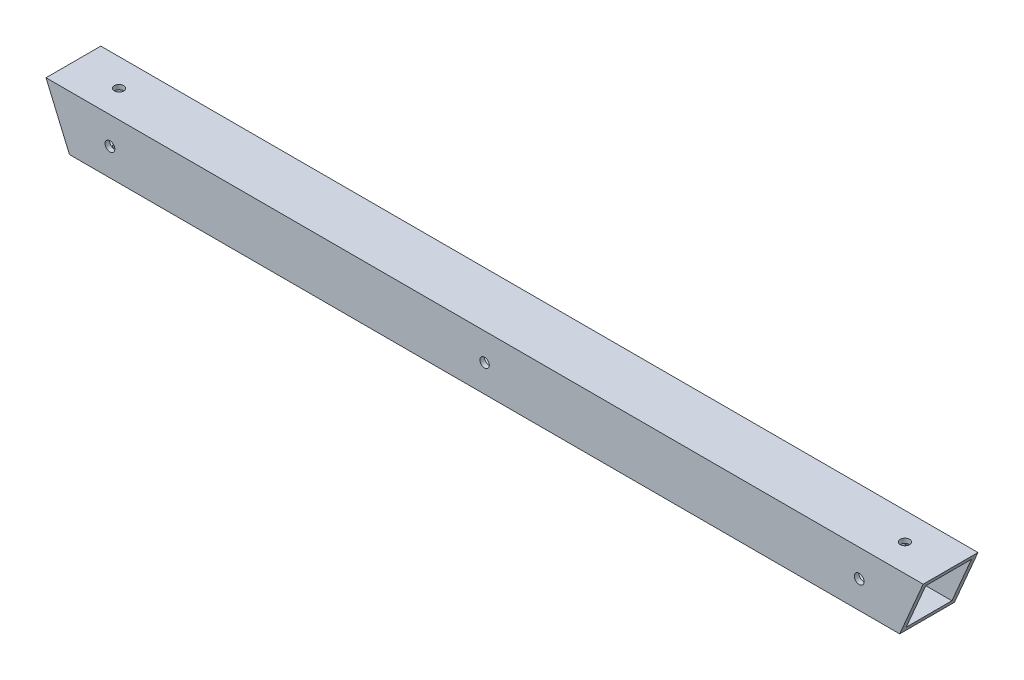
ISO-10303-21;
HEADER;
FILE_DESCRIPTION(('STEP AP214'),'2;1');
FILE_NAME('part.step','',(''),(''),'','','');
FILE_SCHEMA(('AUTOMOTIVE_DESIGN { 1 0 10303 214 1 1 1 1 }'));
ENDSEC;
DATA;
#1=APPLICATION_CONTEXT('core data for automotive mechanical design processes');
#2=APPLICATION_PROTOCOL_DEFINITION('international standard','automotive_design',2000,#1);
#3=PRODUCT_CONTEXT('',#1,'mechanical');
#4=PRODUCT('Part','Part','',(#3));
#5=PRODUCT_RELATED_PRODUCT_CATEGORY('part','',(#4));
#6=PRODUCT_DEFINITION_FORMATION('','',#4);
#7=PRODUCT_DEFINITION_CONTEXT('part definition',#1,'design');
#8=PRODUCT_DEFINITION('design','',#6,#7);
#9=PRODUCT_DEFINITION_SHAPE('','',#8);
#10=(LENGTH_UNIT() NAMED_UNIT(*) SI_UNIT(.MILLI.,.METRE.));
#11=(NAMED_UNIT(*) PLANE_ANGLE_UNIT() SI_UNIT($,.RADIAN.));
#12=(NAMED_UNIT(*) SI_UNIT($,.STERADIAN.) SOLID_ANGLE_UNIT());
#13=UNCERTAINTY_MEASURE_WITH_UNIT(LENGTH_MEASURE(1.E-05),#10,'distance_accuracy_value','');
#14=(GEOMETRIC_REPRESENTATION_CONTEXT(3) GLOBAL_UNCERTAINTY_ASSIGNED_CONTEXT((#13)) GLOBAL_UNIT_ASSIGNED_CONTEXT((#10,
#11,#12)) REPRESENTATION_CONTEXT('',''));
#15=CARTESIAN_POINT('',(0.,0.,0.));
#16=DIRECTION('',(0.,0.,1.));
#17=DIRECTION('',(1.,0.,0.));
#18=AXIS2_PLACEMENT_3D('',#15,#16,#17);
#19=CARTESIAN_POINT('',(304.8,1009.65,-38.1));
#20=DIRECTION('',(0.,-1.,0.));
#21=DIRECTION('',(0.,0.,-1.));
#22=AXIS2_PLACEMENT_3D('',#19,#20,#21);
#23=PLANE('',#22);
#24=CARTESIAN_POINT('',(-273.05,1009.65,-19.0499999999999));
#25=DIRECTION('',(0.,1.,0.));
#26=DIRECTION('',(0.,0.,1.));
#27=AXIS2_PLACEMENT_3D('',#24,#25,#26);
#28=CIRCLE('',#27,3.26389999999999);
#29=CARTESIAN_POINT('',(-273.05,1009.65,-15.7860999999999));
#30=VERTEX_POINT('',#29);
#31=EDGE_CURVE('E176',#30,#30,#28,.T.);
#32=ORIENTED_EDGE('',*,*,#31,.F.);
#33=EDGE_LOOP('',(#32));
#34=FACE_BOUND('',#33,.T.);
#35=CARTESIAN_POINT('',(273.05,1009.65,-19.0499999999999));
#36=DIRECTION('',(0.,1.,0.));
#37=DIRECTION('',(0.,0.,1.));
#38=AXIS2_PLACEMENT_3D('',#35,#36,#37);
#39=CIRCLE('',#38,3.26389999999999);
#40=CARTESIAN_POINT('',(273.05,1009.65,-15.7860999999999));
#41=VERTEX_POINT('',#40);
#42=EDGE_CURVE('E183',#41,#41,#39,.T.);
#43=ORIENTED_EDGE('',*,*,#42,.F.);
#44=EDGE_LOOP('',(#43));
#45=FACE_BOUND('',#44,.T.);
#46=DIRECTION('',(0.,0.,-1.));
#47=VECTOR('',#46,1.);
#48=CARTESIAN_POINT('',(-304.8,1009.65,-38.1));
#49=LINE('',#48,#47);
#50=CARTESIAN_POINT('',(-304.8,1009.65,0.));
#51=VERTEX_POINT('',#50);
#52=CARTESIAN_POINT('',(-304.8,1009.65,-38.1));
#53=VERTEX_POINT('',#52);
#54=EDGE_CURVE('E112',#51,#53,#49,.T.);
#55=ORIENTED_EDGE('',*,*,#54,.F.);
#56=DIRECTION('',(-1.,0.,0.));
#57=VECTOR('',#56,1.);
#58=CARTESIAN_POINT('',(304.8,1009.65,0.));
#59=LINE('',#58,#57);
#60=CARTESIAN_POINT('',(304.8,1009.65,0.));
#61=VERTEX_POINT('',#60);
#62=EDGE_CURVE('E49',#61,#51,#59,.T.);
#63=ORIENTED_EDGE('',*,*,#62,.F.);
#64=DIRECTION('',(0.,0.,1.));
#65=VECTOR('',#64,1.);
#66=CARTESIAN_POINT('',(304.8,1009.65,-38.1));
#67=LINE('',#66,#65);
#68=CARTESIAN_POINT('',(304.8,1009.65,-38.1));
#69=VERTEX_POINT('',#68);
#70=EDGE_CURVE('E124',#69,#61,#67,.T.);
#71=ORIENTED_EDGE('',*,*,#70,.F.);
#72=DIRECTION('',(-1.,0.,0.));
#73=VECTOR('',#72,1.);
#74=CARTESIAN_POINT('',(304.8,1009.65,-38.1));
#75=LINE('',#74,#73);
#76=EDGE_CURVE('E131',#69,#53,#75,.T.);
#77=ORIENTED_EDGE('',*,*,#76,.T.);
#78=EDGE_LOOP('',(#55,#63,#71,#77));
#79=FACE_BOUND('',#78,.T.);
#80=ADVANCED_FACE('F33',(#34,#45,#79),#23,.F.);
#81=CARTESIAN_POINT('',(304.8,971.55,0.));
#82=DIRECTION('',(0.,0.,-1.));
#83=DIRECTION('',(-1.,0.,0.));
#84=AXIS2_PLACEMENT_3D('',#81,#82,#83);
#85=PLANE('',#84);
#86=CARTESIAN_POINT('',(-260.35,990.6,0.));
#87=DIRECTION('',(0.,0.,1.));
#88=DIRECTION('',(1.,0.,0.));
#89=AXIS2_PLACEMENT_3D('',#86,#87,#88);
#90=CIRCLE('',#89,3.3782);
#91=CARTESIAN_POINT('',(-256.9718,990.6,0.));
#92=VERTEX_POINT('',#91);
#93=EDGE_CURVE('E326',#92,#92,#90,.T.);
#94=ORIENTED_EDGE('',*,*,#93,.F.);
#95=EDGE_LOOP('',(#94));
#96=FACE_BOUND('',#95,.T.);
#97=CARTESIAN_POINT('',(260.35,990.6,0.));
#98=DIRECTION('',(0.,0.,1.));
#99=DIRECTION('',(1.,0.,0.));
#100=AXIS2_PLACEMENT_3D('',#97,#98,#99);
#101=CIRCLE('',#100,3.3782);
#102=CARTESIAN_POINT('',(263.7282,990.6,0.));
#103=VERTEX_POINT('',#102);
#104=EDGE_CURVE('E146',#103,#103,#101,.T.);
#105=ORIENTED_EDGE('',*,*,#104,.F.);
#106=EDGE_LOOP('',(#105));
#107=FACE_BOUND('',#106,.T.);
#108=CARTESIAN_POINT('',(-2.77555756156289E-13,990.6,0.));
#109=DIRECTION('',(0.,0.,1.));
#110=DIRECTION('',(1.,0.,0.));
#111=AXIS2_PLACEMENT_3D('',#108,#109,#110);
#112=CIRCLE('',#111,3.26389999999999);
#113=CARTESIAN_POINT('',(3.26389999999971,990.6,0.));
#114=VERTEX_POINT('',#113);
#115=EDGE_CURVE('E164',#114,#114,#112,.T.);
#116=ORIENTED_EDGE('',*,*,#115,.F.);
#117=EDGE_LOOP('',(#116));
#118=FACE_BOUND('',#117,.T.);
#119=DIRECTION('',(-0.393566430849752,0.919296178882621,0.));
#120=VECTOR('',#119,1.);
#121=CARTESIAN_POINT('',(-196.591554343957,756.895692678489,0.));
#122=LINE('',#121,#120);
#123=CARTESIAN_POINT('',(-288.488737797647,971.55,0.));
#124=VERTEX_POINT('',#123);
#125=EDGE_CURVE('E199',#124,#51,#122,.T.);
#126=ORIENTED_EDGE('',*,*,#125,.F.);
#127=DIRECTION('',(-1.,0.,0.));
#128=VECTOR('',#127,1.);
#129=CARTESIAN_POINT('',(304.8,971.55,0.));
#130=LINE('',#129,#128);
#131=CARTESIAN_POINT('',(288.488737797647,971.55,0.));
#132=VERTEX_POINT('',#131);
#133=EDGE_CURVE('E121',#132,#124,#130,.T.);
#134=ORIENTED_EDGE('',*,*,#133,.F.);
#135=DIRECTION('',(-0.393566430849752,-0.919296178882621,0.));
#136=VECTOR('',#135,1.);
#137=CARTESIAN_POINT('',(291.015263179766,977.451481802238,0.));
#138=LINE('',#137,#136);
#139=EDGE_CURVE('E220',#61,#132,#138,.T.);
#140=ORIENTED_EDGE('',*,*,#139,.F.);
#141=ORIENTED_EDGE('',*,*,#62,.T.);
#142=EDGE_LOOP('',(#126,#134,#140,#141));
#143=FACE_BOUND('',#142,.T.);
#144=ADVANCED_FACE('F230',(#96,#107,#118,#143),#85,.F.);
#145=CARTESIAN_POINT('',(304.8,971.55,-38.1));
#146=DIRECTION('',(0.,1.,0.));
#147=DIRECTION('',(0.,0.,1.));
#148=AXIS2_PLACEMENT_3D('',#145,#146,#147);
#149=PLANE('',#148);
#150=CARTESIAN_POINT('',(-273.05,971.55,-19.0499999999999));
#151=DIRECTION('',(0.,1.,0.));
#152=DIRECTION('',(0.,0.,1.));
#153=AXIS2_PLACEMENT_3D('',#150,#151,#152);
#154=CIRCLE('',#153,3.26389999999999);
#155=CARTESIAN_POINT('',(-273.05,971.55,-15.7860999999999));
#156=VERTEX_POINT('',#155);
#157=EDGE_CURVE('E142',#156,#156,#154,.F.);
#158=ORIENTED_EDGE('',*,*,#157,.F.);
#159=EDGE_LOOP('',(#158));
#160=FACE_BOUND('',#159,.T.);
#161=CARTESIAN_POINT('',(273.05,971.55,-19.0499999999999));
#162=DIRECTION('',(0.,1.,0.));
#163=DIRECTION('',(0.,0.,1.));
#164=AXIS2_PLACEMENT_3D('',#161,#162,#163);
#165=CIRCLE('',#164,3.26389999999999);
#166=CARTESIAN_POINT('',(273.05,971.55,-15.7860999999999));
#167=VERTEX_POINT('',#166);
#168=EDGE_CURVE('E184',#167,#167,#165,.F.);
#169=ORIENTED_EDGE('',*,*,#168,.F.);
#170=EDGE_LOOP('',(#169));
#171=FACE_BOUND('',#170,.T.);
#172=DIRECTION('',(0.,0.,1.));
#173=VECTOR('',#172,1.);
#174=CARTESIAN_POINT('',(-288.488737797647,971.55,-38.1));
#175=LINE('',#174,#173);
#176=CARTESIAN_POINT('',(-288.488737797647,971.55,-38.1));
#177=VERTEX_POINT('',#176);
#178=EDGE_CURVE('E202',#177,#124,#175,.T.);
#179=ORIENTED_EDGE('',*,*,#178,.F.);
#180=DIRECTION('',(-1.,0.,0.));
#181=VECTOR('',#180,1.);
#182=CARTESIAN_POINT('',(304.8,971.55,-38.1));
#183=LINE('',#182,#181);
#184=CARTESIAN_POINT('',(288.488737797647,971.55,-38.1));
#185=VERTEX_POINT('',#184);
#186=EDGE_CURVE('E133',#185,#177,#183,.T.);
#187=ORIENTED_EDGE('',*,*,#186,.F.);
#188=DIRECTION('',(0.,0.,-1.));
#189=VECTOR('',#188,1.);
#190=CARTESIAN_POINT('',(288.488737797647,971.55,-38.1));
#191=LINE('',#190,#189);
#192=EDGE_CURVE('E218',#132,#185,#191,.T.);
#193=ORIENTED_EDGE('',*,*,#192,.F.);
#194=ORIENTED_EDGE('',*,*,#133,.T.);
#195=EDGE_LOOP('',(#179,#187,#193,#194));
#196=FACE_BOUND('',#195,.T.);
#197=ADVANCED_FACE('F232',(#160,#171,#196),#149,.F.);
#198=CARTESIAN_POINT('',(304.8,971.55,-38.1));
#199=DIRECTION('',(0.,0.,1.));
#200=DIRECTION('',(1.,0.,0.));
#201=AXIS2_PLACEMENT_3D('',#198,#199,#200);
#202=PLANE('',#201);
#203=CARTESIAN_POINT('',(-260.35,990.6,-38.1));
#204=DIRECTION('',(0.,0.,1.));
#205=DIRECTION('',(1.,0.,0.));
#206=AXIS2_PLACEMENT_3D('',#203,#204,#205);
#207=CIRCLE('',#206,3.3782);
#208=CARTESIAN_POINT('',(-256.9718,990.6,-38.1));
#209=VERTEX_POINT('',#208);
#210=EDGE_CURVE('E36',#209,#209,#207,.T.);
#211=ORIENTED_EDGE('',*,*,#210,.T.);
#212=EDGE_LOOP('',(#211));
#213=FACE_BOUND('',#212,.T.);
#214=CARTESIAN_POINT('',(260.35,990.6,-38.1));
#215=DIRECTION('',(0.,0.,1.));
#216=DIRECTION('',(1.,0.,0.));
#217=AXIS2_PLACEMENT_3D('',#214,#215,#216);
#218=CIRCLE('',#217,3.3782);
#219=CARTESIAN_POINT('',(263.7282,990.6,-38.1));
#220=VERTEX_POINT('',#219);
#221=EDGE_CURVE('E145',#220,#220,#218,.T.);
#222=ORIENTED_EDGE('',*,*,#221,.T.);
#223=EDGE_LOOP('',(#222));
#224=FACE_BOUND('',#223,.T.);
#225=CARTESIAN_POINT('',(-2.77555756156289E-13,990.6,-38.1));
#226=DIRECTION('',(0.,0.,1.));
#227=DIRECTION('',(1.,0.,0.));
#228=AXIS2_PLACEMENT_3D('',#225,#226,#227);
#229=CIRCLE('',#228,3.26389999999998);
#230=CARTESIAN_POINT('',(3.26389999999971,990.6,-38.1));
#231=VERTEX_POINT('',#230);
#232=EDGE_CURVE('E167',#231,#231,#229,.T.);
#233=ORIENTED_EDGE('',*,*,#232,.T.);
#234=EDGE_LOOP('',(#233));
#235=FACE_BOUND('',#234,.T.);
#236=DIRECTION('',(0.393566430849752,-0.919296178882621,0.));
#237=VECTOR('',#236,1.);
#238=CARTESIAN_POINT('',(-196.591554343957,756.895692678489,-38.1));
#239=LINE('',#238,#237);
#240=EDGE_CURVE('E205',#53,#177,#239,.T.);
#241=ORIENTED_EDGE('',*,*,#240,.F.);
#242=ORIENTED_EDGE('',*,*,#76,.F.);
#243=DIRECTION('',(0.393566430849752,0.919296178882621,0.));
#244=VECTOR('',#243,1.);
#245=CARTESIAN_POINT('',(291.015263179766,977.451481802238,-38.1));
#246=LINE('',#245,#244);
#247=EDGE_CURVE('E215',#185,#69,#246,.T.);
#248=ORIENTED_EDGE('',*,*,#247,.F.);
#249=ORIENTED_EDGE('',*,*,#186,.T.);
#250=EDGE_LOOP('',(#241,#242,#248,#249));
#251=FACE_BOUND('',#250,.T.);
#252=ADVANCED_FACE('F234',(#213,#224,#235,#251),#202,.F.);
#253=CARTESIAN_POINT('',(304.8,1009.65,0.));
#254=DIRECTION('',(0.919296178882621,-0.393566430849752,0.));
#255=DIRECTION('',(0.393566430849752,0.919296178882621,0.));
#256=AXIS2_PLACEMENT_3D('',#253,#254,#255);
#257=PLANE('',#256);
#258=DIRECTION('',(0.,0.,1.));
#259=VECTOR('',#258,1.);
#260=CARTESIAN_POINT('',(303.440728149804,1006.475,-34.925));
#261=LINE('',#260,#259);
#262=CARTESIAN_POINT('',(303.440728149804,1006.475,-34.925));
#263=VERTEX_POINT('',#262);
#264=CARTESIAN_POINT('',(303.440728149804,1006.475,-3.175));
#265=VERTEX_POINT('',#264);
#266=EDGE_CURVE('E117',#263,#265,#261,.T.);
#267=ORIENTED_EDGE('',*,*,#266,.F.);
#268=DIRECTION('',(0.393566430849752,0.919296178882621,0.));
#269=VECTOR('',#268,1.);
#270=CARTESIAN_POINT('',(292.163991248119,980.134691652051,-34.925));
#271=LINE('',#270,#269);
#272=CARTESIAN_POINT('',(289.848009647843,974.725,-34.925));
#273=VERTEX_POINT('',#272);
#274=EDGE_CURVE('E211',#273,#263,#271,.T.);
#275=ORIENTED_EDGE('',*,*,#274,.F.);
#276=DIRECTION('',(0.,0.,-1.));
#277=VECTOR('',#276,1.);
#278=CARTESIAN_POINT('',(289.848009647843,974.725,-34.925));
#279=LINE('',#278,#277);
#280=CARTESIAN_POINT('',(289.848009647843,974.725,-3.175));
#281=VERTEX_POINT('',#280);
#282=EDGE_CURVE('E208',#281,#273,#279,.T.);
#283=ORIENTED_EDGE('',*,*,#282,.F.);
#284=DIRECTION('',(-0.393566430849752,-0.919296178882621,0.));
#285=VECTOR('',#284,1.);
#286=CARTESIAN_POINT('',(292.163991248119,980.134691652051,-3.175));
#287=LINE('',#286,#285);
#288=EDGE_CURVE('E41',#265,#281,#287,.T.);
#289=ORIENTED_EDGE('',*,*,#288,.F.);
#290=EDGE_LOOP('',(#267,#275,#283,#289));
#291=FACE_BOUND('',#290,.T.);
#292=ORIENTED_EDGE('',*,*,#247,.T.);
#293=ORIENTED_EDGE('',*,*,#70,.T.);
#294=ORIENTED_EDGE('',*,*,#139,.T.);
#295=ORIENTED_EDGE('',*,*,#192,.T.);
#296=EDGE_LOOP('',(#292,#293,#294,#295));
#297=FACE_BOUND('',#296,.T.);
#298=ADVANCED_FACE('F225',(#291,#297),#257,.T.);
#299=CARTESIAN_POINT('',(304.8,1006.475,-34.925));
#300=DIRECTION('',(0.,-1.,0.));
#301=DIRECTION('',(0.,0.,-1.));
#302=AXIS2_PLACEMENT_3D('',#299,#300,#301);
#303=PLANE('',#302);
#304=CARTESIAN_POINT('',(-273.05,1006.475,-19.0499999999999));
#305=DIRECTION('',(0.,-1.,0.));
#306=DIRECTION('',(0.,0.,-1.));
#307=AXIS2_PLACEMENT_3D('',#304,#305,#306);
#308=CIRCLE('',#307,3.26389999999999);
#309=CARTESIAN_POINT('',(-273.05,1006.475,-22.3138999999999));
#310=VERTEX_POINT('',#309);
#311=EDGE_CURVE('E141',#310,#310,#308,.T.);
#312=ORIENTED_EDGE('',*,*,#311,.F.);
#313=EDGE_LOOP('',(#312));
#314=FACE_BOUND('',#313,.T.);
#315=CARTESIAN_POINT('',(273.05,1006.475,-19.0499999999999));
#316=DIRECTION('',(0.,-1.,0.));
#317=DIRECTION('',(0.,0.,-1.));
#318=AXIS2_PLACEMENT_3D('',#315,#316,#317);
#319=CIRCLE('',#318,3.26389999999999);
#320=CARTESIAN_POINT('',(273.05,1006.475,-22.3138999999999));
#321=VERTEX_POINT('',#320);
#322=EDGE_CURVE('E192',#321,#321,#319,.T.);
#323=ORIENTED_EDGE('',*,*,#322,.F.);
#324=EDGE_LOOP('',(#323));
#325=FACE_BOUND('',#324,.T.);
#326=DIRECTION('',(-1.,0.,0.));
#327=VECTOR('',#326,1.);
#328=CARTESIAN_POINT('',(304.8,1006.475,-3.175));
#329=LINE('',#328,#327);
#330=CARTESIAN_POINT('',(-303.440728149804,1006.475,-3.175));
#331=VERTEX_POINT('',#330);
#332=EDGE_CURVE('E108',#265,#331,#329,.T.);
#333=ORIENTED_EDGE('',*,*,#332,.T.);
#334=DIRECTION('',(0.,0.,-1.));
#335=VECTOR('',#334,1.);
#336=CARTESIAN_POINT('',(-303.440728149804,1006.475,-34.925));
#337=LINE('',#336,#335);
#338=CARTESIAN_POINT('',(-303.440728149804,1006.475,-34.925));
#339=VERTEX_POINT('',#338);
#340=EDGE_CURVE('E11',#331,#339,#337,.T.);
#341=ORIENTED_EDGE('',*,*,#340,.T.);
#342=DIRECTION('',(-1.,0.,0.));
#343=VECTOR('',#342,1.);
#344=CARTESIAN_POINT('',(304.8,1006.475,-34.925));
#345=LINE('',#344,#343);
#346=EDGE_CURVE('E129',#263,#339,#345,.T.);
#347=ORIENTED_EDGE('',*,*,#346,.F.);
#348=ORIENTED_EDGE('',*,*,#266,.T.);
#349=EDGE_LOOP('',(#333,#341,#347,#348));
#350=FACE_BOUND('',#349,.T.);
#351=ADVANCED_FACE('F116',(#314,#325,#350),#303,.T.);
#352=CARTESIAN_POINT('',(304.8,974.725,-34.925));
#353=DIRECTION('',(0.,0.,1.));
#354=DIRECTION('',(1.,0.,0.));
#355=AXIS2_PLACEMENT_3D('',#352,#353,#354);
#356=PLANE('',#355);
#357=CARTESIAN_POINT('',(-260.35,990.6,-34.925));
#358=DIRECTION('',(0.,0.,1.));
#359=DIRECTION('',(1.,0.,0.));
#360=AXIS2_PLACEMENT_3D('',#357,#358,#359);
#361=CIRCLE('',#360,3.3782);
#362=CARTESIAN_POINT('',(-256.9718,990.6,-34.925));
#363=VERTEX_POINT('',#362);
#364=EDGE_CURVE('E153',#363,#363,#361,.T.);
#365=ORIENTED_EDGE('',*,*,#364,.F.);
#366=EDGE_LOOP('',(#365));
#367=FACE_BOUND('',#366,.T.);
#368=CARTESIAN_POINT('',(260.35,990.6,-34.925));
#369=DIRECTION('',(0.,0.,1.));
#370=DIRECTION('',(1.,0.,0.));
#371=AXIS2_PLACEMENT_3D('',#368,#369,#370);
#372=CIRCLE('',#371,3.3782);
#373=CARTESIAN_POINT('',(263.7282,990.6,-34.925));
#374=VERTEX_POINT('',#373);
#375=EDGE_CURVE('E143',#374,#374,#372,.T.);
#376=ORIENTED_EDGE('',*,*,#375,.F.);
#377=EDGE_LOOP('',(#376));
#378=FACE_BOUND('',#377,.T.);
#379=CARTESIAN_POINT('',(-2.77555756156289E-13,990.6,-34.925));
#380=DIRECTION('',(0.,0.,1.));
#381=DIRECTION('',(1.,0.,0.));
#382=AXIS2_PLACEMENT_3D('',#379,#380,#381);
#383=CIRCLE('',#382,3.26389999999999);
#384=CARTESIAN_POINT('',(3.26389999999971,990.6,-34.925));
#385=VERTEX_POINT('',#384);
#386=EDGE_CURVE('E173',#385,#385,#383,.T.);
#387=ORIENTED_EDGE('',*,*,#386,.F.);
#388=EDGE_LOOP('',(#387));
#389=FACE_BOUND('',#388,.T.);
#390=ORIENTED_EDGE('',*,*,#346,.T.);
#391=DIRECTION('',(0.393566430849752,-0.919296178882621,0.));
#392=VECTOR('',#391,1.);
#393=CARTESIAN_POINT('',(-197.74028241231,759.578902528302,-34.925));
#394=LINE('',#393,#392);
#395=CARTESIAN_POINT('',(-289.848009647843,974.725,-34.925));
#396=VERTEX_POINT('',#395);
#397=EDGE_CURVE('E57',#339,#396,#394,.T.);
#398=ORIENTED_EDGE('',*,*,#397,.T.);
#399=DIRECTION('',(-1.,0.,0.));
#400=VECTOR('',#399,1.);
#401=CARTESIAN_POINT('',(304.8,974.725,-34.925));
#402=LINE('',#401,#400);
#403=EDGE_CURVE('E119',#273,#396,#402,.T.);
#404=ORIENTED_EDGE('',*,*,#403,.F.);
#405=ORIENTED_EDGE('',*,*,#274,.T.);
#406=EDGE_LOOP('',(#390,#398,#404,#405));
#407=FACE_BOUND('',#406,.T.);
#408=ADVANCED_FACE('F283',(#367,#378,#389,#407),#356,.T.);
#409=CARTESIAN_POINT('',(304.8,974.725,-34.925));
#410=DIRECTION('',(0.,1.,0.));
#411=DIRECTION('',(0.,0.,1.));
#412=AXIS2_PLACEMENT_3D('',#409,#410,#411);
#413=PLANE('',#412);
#414=CARTESIAN_POINT('',(-273.05,974.725,-19.0499999999999));
#415=DIRECTION('',(0.,1.,0.));
#416=DIRECTION('',(0.,0.,1.));
#417=AXIS2_PLACEMENT_3D('',#414,#415,#416);
#418=CIRCLE('',#417,3.26389999999999);
#419=CARTESIAN_POINT('',(-273.05,974.725,-15.7860999999999));
#420=VERTEX_POINT('',#419);
#421=EDGE_CURVE('E139',#420,#420,#418,.T.);
#422=ORIENTED_EDGE('',*,*,#421,.F.);
#423=EDGE_LOOP('',(#422));
#424=FACE_BOUND('',#423,.T.);
#425=CARTESIAN_POINT('',(273.05,974.725,-19.0499999999999));
#426=DIRECTION('',(0.,1.,0.));
#427=DIRECTION('',(0.,0.,1.));
#428=AXIS2_PLACEMENT_3D('',#425,#426,#427);
#429=CIRCLE('',#428,3.26389999999999);
#430=CARTESIAN_POINT('',(273.05,974.725,-15.7860999999999));
#431=VERTEX_POINT('',#430);
#432=EDGE_CURVE('E187',#431,#431,#429,.T.);
#433=ORIENTED_EDGE('',*,*,#432,.F.);
#434=EDGE_LOOP('',(#433));
#435=FACE_BOUND('',#434,.T.);
#436=ORIENTED_EDGE('',*,*,#403,.T.);
#437=DIRECTION('',(0.,0.,1.));
#438=VECTOR('',#437,1.);
#439=CARTESIAN_POINT('',(-289.848009647843,974.725,-34.925));
#440=LINE('',#439,#438);
#441=CARTESIAN_POINT('',(-289.848009647843,974.725,-3.175));
#442=VERTEX_POINT('',#441);
#443=EDGE_CURVE('E113',#396,#442,#440,.T.);
#444=ORIENTED_EDGE('',*,*,#443,.T.);
#445=DIRECTION('',(-1.,0.,0.));
#446=VECTOR('',#445,1.);
#447=CARTESIAN_POINT('',(304.8,974.725,-3.175));
#448=LINE('',#447,#446);
#449=EDGE_CURVE('E110',#281,#442,#448,.T.);
#450=ORIENTED_EDGE('',*,*,#449,.F.);
#451=ORIENTED_EDGE('',*,*,#282,.T.);
#452=EDGE_LOOP('',(#436,#444,#450,#451));
#453=FACE_BOUND('',#452,.T.);
#454=ADVANCED_FACE('F279',(#424,#435,#453),#413,.T.);
#455=CARTESIAN_POINT('',(304.8,974.725,-3.175));
#456=DIRECTION('',(0.,0.,-1.));
#457=DIRECTION('',(-1.,0.,0.));
#458=AXIS2_PLACEMENT_3D('',#455,#456,#457);
#459=PLANE('',#458);
#460=CARTESIAN_POINT('',(-260.35,990.6,-3.175));
#461=DIRECTION('',(0.,0.,-1.));
#462=DIRECTION('',(-1.,0.,0.));
#463=AXIS2_PLACEMENT_3D('',#460,#461,#462);
#464=CIRCLE('',#463,3.3782);
#465=CARTESIAN_POINT('',(-263.7282,990.6,-3.175));
#466=VERTEX_POINT('',#465);
#467=EDGE_CURVE('E158',#466,#466,#464,.T.);
#468=ORIENTED_EDGE('',*,*,#467,.F.);
#469=EDGE_LOOP('',(#468));
#470=FACE_BOUND('',#469,.T.);
#471=CARTESIAN_POINT('',(260.35,990.6,-3.175));
#472=DIRECTION('',(0.,0.,-1.));
#473=DIRECTION('',(-1.,0.,0.));
#474=AXIS2_PLACEMENT_3D('',#471,#472,#473);
#475=CIRCLE('',#474,3.3782);
#476=CARTESIAN_POINT('',(256.9718,990.6,-3.175));
#477=VERTEX_POINT('',#476);
#478=EDGE_CURVE('E150',#477,#477,#475,.T.);
#479=ORIENTED_EDGE('',*,*,#478,.F.);
#480=EDGE_LOOP('',(#479));
#481=FACE_BOUND('',#480,.T.);
#482=CARTESIAN_POINT('',(-2.77555756156289E-13,990.6,-3.175));
#483=DIRECTION('',(0.,0.,-1.));
#484=DIRECTION('',(-1.,0.,0.));
#485=AXIS2_PLACEMENT_3D('',#482,#483,#484);
#486=CIRCLE('',#485,3.26389999999999);
#487=CARTESIAN_POINT('',(-3.26390000000026,990.6,-3.175));
#488=VERTEX_POINT('',#487);
#489=EDGE_CURVE('E170',#488,#488,#486,.T.);
#490=ORIENTED_EDGE('',*,*,#489,.F.);
#491=EDGE_LOOP('',(#490));
#492=FACE_BOUND('',#491,.T.);
#493=ORIENTED_EDGE('',*,*,#449,.T.);
#494=DIRECTION('',(-0.393566430849752,0.919296178882621,0.));
#495=VECTOR('',#494,1.);
#496=CARTESIAN_POINT('',(-197.74028241231,759.578902528302,-3.175));
#497=LINE('',#496,#495);
#498=EDGE_CURVE('E99',#442,#331,#497,.T.);
#499=ORIENTED_EDGE('',*,*,#498,.T.);
#500=ORIENTED_EDGE('',*,*,#332,.F.);
#501=ORIENTED_EDGE('',*,*,#288,.T.);
#502=EDGE_LOOP('',(#493,#499,#500,#501));
#503=FACE_BOUND('',#502,.T.);
#504=ADVANCED_FACE('F106',(#470,#481,#492,#503),#459,.T.);
#505=CARTESIAN_POINT('',(-304.8,1009.65,0.));
#506=DIRECTION('',(-0.919296178882621,-0.393566430849752,0.));
#507=DIRECTION('',(0.393566430849752,-0.919296178882621,0.));
#508=AXIS2_PLACEMENT_3D('',#505,#506,#507);
#509=PLANE('',#508);
#510=ORIENTED_EDGE('',*,*,#498,.F.);
#511=ORIENTED_EDGE('',*,*,#443,.F.);
#512=ORIENTED_EDGE('',*,*,#397,.F.);
#513=ORIENTED_EDGE('',*,*,#340,.F.);
#514=EDGE_LOOP('',(#510,#511,#512,#513));
#515=FACE_BOUND('',#514,.T.);
#516=ORIENTED_EDGE('',*,*,#54,.T.);
#517=ORIENTED_EDGE('',*,*,#240,.T.);
#518=ORIENTED_EDGE('',*,*,#178,.T.);
#519=ORIENTED_EDGE('',*,*,#125,.T.);
#520=EDGE_LOOP('',(#516,#517,#518,#519));
#521=FACE_BOUND('',#520,.T.);
#522=ADVANCED_FACE('F97',(#515,#521),#509,.T.);
#523=CARTESIAN_POINT('',(273.05,1009.65,-19.0499999999999));
#524=DIRECTION('',(0.,1.,0.));
#525=DIRECTION('',(0.,0.,1.));
#526=AXIS2_PLACEMENT_3D('',#523,#524,#525);
#527=CYLINDRICAL_SURFACE('',#526,3.26389999999999);
#528=ORIENTED_EDGE('',*,*,#432,.T.);
#529=EDGE_LOOP('',(#528));
#530=FACE_BOUND('',#529,.T.);
#531=ORIENTED_EDGE('',*,*,#168,.T.);
#532=EDGE_LOOP('',(#531));
#533=FACE_BOUND('',#532,.T.);
#534=ADVANCED_FACE('F262',(#530,#533),#527,.F.);
#535=ORIENTED_EDGE('',*,*,#322,.T.);
#536=EDGE_LOOP('',(#535));
#537=FACE_BOUND('',#536,.T.);
#538=ORIENTED_EDGE('',*,*,#42,.T.);
#539=EDGE_LOOP('',(#538));
#540=FACE_BOUND('',#539,.T.);
#541=ADVANCED_FACE('F259',(#537,#540),#527,.F.);
#542=CARTESIAN_POINT('',(-273.05,1009.65,-19.0499999999999));
#543=DIRECTION('',(0.,1.,0.));
#544=DIRECTION('',(0.,0.,1.));
#545=AXIS2_PLACEMENT_3D('',#542,#543,#544);
#546=CYLINDRICAL_SURFACE('',#545,3.26389999999999);
#547=ORIENTED_EDGE('',*,*,#421,.T.);
#548=EDGE_LOOP('',(#547));
#549=FACE_BOUND('',#548,.T.);
#550=ORIENTED_EDGE('',*,*,#157,.T.);
#551=EDGE_LOOP('',(#550));
#552=FACE_BOUND('',#551,.T.);
#553=ADVANCED_FACE('F261',(#549,#552),#546,.F.);
#554=ORIENTED_EDGE('',*,*,#311,.T.);
#555=EDGE_LOOP('',(#554));
#556=FACE_BOUND('',#555,.T.);
#557=ORIENTED_EDGE('',*,*,#31,.T.);
#558=EDGE_LOOP('',(#557));
#559=FACE_BOUND('',#558,.T.);
#560=ADVANCED_FACE('F269',(#556,#559),#546,.F.);
#561=CARTESIAN_POINT('',(-2.77555756156289E-13,990.6,0.));
#562=DIRECTION('',(0.,0.,1.));
#563=DIRECTION('',(1.,0.,0.));
#564=AXIS2_PLACEMENT_3D('',#561,#562,#563);
#565=CYLINDRICAL_SURFACE('',#564,3.26389999999999);
#566=ORIENTED_EDGE('',*,*,#386,.T.);
#567=EDGE_LOOP('',(#566));
#568=FACE_BOUND('',#567,.T.);
#569=ORIENTED_EDGE('',*,*,#232,.F.);
#570=EDGE_LOOP('',(#569));
#571=FACE_BOUND('',#570,.T.);
#572=ADVANCED_FACE('F297',(#568,#571),#565,.F.);
#573=ORIENTED_EDGE('',*,*,#489,.T.);
#574=EDGE_LOOP('',(#573));
#575=FACE_BOUND('',#574,.T.);
#576=ORIENTED_EDGE('',*,*,#115,.T.);
#577=EDGE_LOOP('',(#576));
#578=FACE_BOUND('',#577,.T.);
#579=ADVANCED_FACE('F301',(#575,#578),#565,.F.);
#580=CARTESIAN_POINT('',(260.35,990.6,0.));
#581=DIRECTION('',(0.,0.,1.));
#582=DIRECTION('',(1.,0.,0.));
#583=AXIS2_PLACEMENT_3D('',#580,#581,#582);
#584=CYLINDRICAL_SURFACE('',#583,3.3782);
#585=CARTESIAN_POINT('',(263.7282,990.6,-34.925));
#586=CARTESIAN_POINT('',(263.7282,990.6,-34.9580729166667));
#587=CARTESIAN_POINT('',(263.7282,990.6,-34.9911458333333));
#588=CARTESIAN_POINT('',(263.7282,990.6,-35.0572916666667));
#589=CARTESIAN_POINT('',(263.7282,990.6,-35.0903645833333));
#590=CARTESIAN_POINT('',(263.7282,990.6,-35.1565104166667));
#591=CARTESIAN_POINT('',(263.7282,990.6,-35.1895833333333));
#592=CARTESIAN_POINT('',(263.7282,990.6,-35.2557291666667));
#593=CARTESIAN_POINT('',(263.7282,990.6,-35.2888020833333));
#594=CARTESIAN_POINT('',(263.7282,990.6,-35.3549479166667));
#595=CARTESIAN_POINT('',(263.7282,990.6,-35.3880208333333));
#596=CARTESIAN_POINT('',(263.7282,990.6,-35.4541666666667));
#597=CARTESIAN_POINT('',(263.7282,990.6,-35.4872395833333));
#598=CARTESIAN_POINT('',(263.7282,990.6,-35.5533854166667));
#599=CARTESIAN_POINT('',(263.7282,990.6,-35.5864583333333));
#600=CARTESIAN_POINT('',(263.7282,990.6,-35.6526041666667));
#601=CARTESIAN_POINT('',(263.7282,990.6,-35.6856770833333));
#602=CARTESIAN_POINT('',(263.7282,990.6,-35.7518229166667));
#603=CARTESIAN_POINT('',(263.7282,990.6,-35.7848958333333));
#604=CARTESIAN_POINT('',(263.7282,990.6,-35.8510416666667));
#605=CARTESIAN_POINT('',(263.7282,990.6,-35.8841145833333));
#606=CARTESIAN_POINT('',(263.7282,990.6,-35.9502604166667));
#607=CARTESIAN_POINT('',(263.7282,990.6,-35.9833333333333));
#608=CARTESIAN_POINT('',(263.7282,990.6,-36.0494791666667));
#609=CARTESIAN_POINT('',(263.7282,990.6,-36.0825520833333));
#610=CARTESIAN_POINT('',(263.7282,990.6,-36.1486979166667));
#611=CARTESIAN_POINT('',(263.7282,990.6,-36.1817708333333));
#612=CARTESIAN_POINT('',(263.7282,990.6,-36.2479166666667));
#613=CARTESIAN_POINT('',(263.7282,990.6,-36.2809895833333));
#614=CARTESIAN_POINT('',(263.7282,990.6,-36.3471354166667));
#615=CARTESIAN_POINT('',(263.7282,990.6,-36.3802083333333));
#616=CARTESIAN_POINT('',(263.7282,990.6,-36.4463541666667));
#617=CARTESIAN_POINT('',(263.7282,990.6,-36.4794270833333));
#618=CARTESIAN_POINT('',(263.7282,990.6,-36.5455729166667));
#619=CARTESIAN_POINT('',(263.7282,990.6,-36.5786458333333));
#620=CARTESIAN_POINT('',(263.7282,990.6,-36.6447916666667));
#621=CARTESIAN_POINT('',(263.7282,990.6,-36.6778645833333));
#622=CARTESIAN_POINT('',(263.7282,990.6,-36.7440104166667));
#623=CARTESIAN_POINT('',(263.7282,990.6,-36.7770833333333));
#624=CARTESIAN_POINT('',(263.7282,990.6,-36.8432291666667));
#625=CARTESIAN_POINT('',(263.7282,990.6,-36.8763020833333));
#626=CARTESIAN_POINT('',(263.7282,990.6,-36.9424479166667));
#627=CARTESIAN_POINT('',(263.7282,990.6,-36.9755208333333));
#628=CARTESIAN_POINT('',(263.7282,990.6,-37.0416666666667));
#629=CARTESIAN_POINT('',(263.7282,990.6,-37.0747395833333));
#630=CARTESIAN_POINT('',(263.7282,990.6,-37.1408854166667));
#631=CARTESIAN_POINT('',(263.7282,990.6,-37.1739583333333));
#632=CARTESIAN_POINT('',(263.7282,990.6,-37.2401041666667));
#633=CARTESIAN_POINT('',(263.7282,990.6,-37.2731770833333));
#634=CARTESIAN_POINT('',(263.7282,990.6,-37.3393229166667));
#635=CARTESIAN_POINT('',(263.7282,990.6,-37.3723958333333));
#636=CARTESIAN_POINT('',(263.7282,990.6,-37.4385416666667));
#637=CARTESIAN_POINT('',(263.7282,990.6,-37.4716145833333));
#638=CARTESIAN_POINT('',(263.7282,990.6,-37.5377604166667));
#639=CARTESIAN_POINT('',(263.7282,990.6,-37.5708333333333));
#640=CARTESIAN_POINT('',(263.7282,990.6,-37.6369791666667));
#641=CARTESIAN_POINT('',(263.7282,990.6,-37.6700520833333));
#642=CARTESIAN_POINT('',(263.7282,990.6,-37.7361979166667));
#643=CARTESIAN_POINT('',(263.7282,990.6,-37.7692708333333));
#644=CARTESIAN_POINT('',(263.7282,990.6,-37.8354166666667));
#645=CARTESIAN_POINT('',(263.7282,990.6,-37.8684895833333));
#646=CARTESIAN_POINT('',(263.7282,990.6,-37.9346354166667));
#647=CARTESIAN_POINT('',(263.7282,990.6,-37.9677083333333));
#648=CARTESIAN_POINT('',(263.7282,990.6,-38.0338541666667));
#649=CARTESIAN_POINT('',(263.7282,990.6,-38.0669270833333));
#650=CARTESIAN_POINT('',(263.7282,990.6,-38.1));
#651=B_SPLINE_CURVE_WITH_KNOTS('',3,(#585,#586,#587,#588,#589,#590,#591,#592,#593,#594,#595,
#596,#597,#598,#599,#600,#601,#602,#603,#604,#605,#606,#607,#608,#609,#610,#611,#612,#613,#614,
#615,#616,#617,#618,#619,#620,#621,#622,#623,#624,#625,#626,#627,#628,#629,#630,#631,#632,#633,
#634,#635,#636,#637,#638,#639,#640,#641,#642,#643,#644,#645,#646,#647,#648,#649,#650),
.UNSPECIFIED.,.F.,.F.,(4,2,2,2,2,2,2,2,2,2,2,2,2,2,2,2,2,2,2,2,2,2,2,2,2,2,2,2,2,2,2,2,4),(0.,
0.0992187499999977,0.198437500000002,0.29765625,0.396875000000005,0.496093750000003,0.5953125,
0.694531250000005,0.793750000000003,0.892968750000001,0.992187500000005,1.09140625,1.190625,
1.28984375000001,1.3890625,1.48828125000001,1.58750000000001,1.68671875,1.78593750000001,
1.88515625000001,1.98437500000001,2.08359375000001,2.18281250000001,2.28203125000001,
2.38125000000001,2.48046875000001,2.57968750000001,2.67890625000001,2.77812500000001,
2.87734375000001,2.97656250000001,3.07578125000001,3.17500000000001),.UNSPECIFIED.);
#652=EDGE_CURVE('BSEAM306',#374,#220,#651,.T.);
#653=ORIENTED_EDGE('',*,*,#375,.T.);
#654=ORIENTED_EDGE('',*,*,#221,.F.);
#655=ORIENTED_EDGE('',*,*,#652,.T.);
#656=ORIENTED_EDGE('',*,*,#652,.F.);
#657=EDGE_LOOP('',(#653,#655,#654,#656));
#658=FACE_BOUND('',#657,.T.);
#659=ADVANCED_FACE('F306',(#658),#584,.F.);
#660=ORIENTED_EDGE('',*,*,#478,.T.);
#661=EDGE_LOOP('',(#660));
#662=FACE_BOUND('',#661,.T.);
#663=ORIENTED_EDGE('',*,*,#104,.T.);
#664=EDGE_LOOP('',(#663));
#665=FACE_BOUND('',#664,.T.);
#666=ADVANCED_FACE('F312',(#662,#665),#584,.F.);
#667=CARTESIAN_POINT('',(-260.35,990.6,0.));
#668=DIRECTION('',(0.,0.,1.));
#669=DIRECTION('',(1.,0.,0.));
#670=AXIS2_PLACEMENT_3D('',#667,#668,#669);
#671=CYLINDRICAL_SURFACE('',#670,3.3782);
#672=CARTESIAN_POINT('',(-256.9718,990.6,-34.925));
#673=CARTESIAN_POINT('',(-256.9718,990.6,-34.9580729166667));
#674=CARTESIAN_POINT('',(-256.9718,990.6,-34.9911458333333));
#675=CARTESIAN_POINT('',(-256.9718,990.6,-35.0572916666667));
#676=CARTESIAN_POINT('',(-256.9718,990.6,-35.0903645833333));
#677=CARTESIAN_POINT('',(-256.9718,990.6,-35.1565104166667));
#678=CARTESIAN_POINT('',(-256.9718,990.6,-35.1895833333333));
#679=CARTESIAN_POINT('',(-256.9718,990.6,-35.2557291666667));
#680=CARTESIAN_POINT('',(-256.9718,990.6,-35.2888020833333));
#681=CARTESIAN_POINT('',(-256.9718,990.6,-35.3549479166667));
#682=CARTESIAN_POINT('',(-256.9718,990.6,-35.3880208333333));
#683=CARTESIAN_POINT('',(-256.9718,990.6,-35.4541666666667));
#684=CARTESIAN_POINT('',(-256.9718,990.6,-35.4872395833333));
#685=CARTESIAN_POINT('',(-256.9718,990.6,-35.5533854166667));
#686=CARTESIAN_POINT('',(-256.9718,990.6,-35.5864583333333));
#687=CARTESIAN_POINT('',(-256.9718,990.6,-35.6526041666667));
#688=CARTESIAN_POINT('',(-256.9718,990.6,-35.6856770833333));
#689=CARTESIAN_POINT('',(-256.9718,990.6,-35.7518229166667));
#690=CARTESIAN_POINT('',(-256.9718,990.6,-35.7848958333333));
#691=CARTESIAN_POINT('',(-256.9718,990.6,-35.8510416666667));
#692=CARTESIAN_POINT('',(-256.9718,990.6,-35.8841145833333));
#693=CARTESIAN_POINT('',(-256.9718,990.6,-35.9502604166667));
#694=CARTESIAN_POINT('',(-256.9718,990.6,-35.9833333333333));
#695=CARTESIAN_POINT('',(-256.9718,990.6,-36.0494791666667));
#696=CARTESIAN_POINT('',(-256.9718,990.6,-36.0825520833333));
#697=CARTESIAN_POINT('',(-256.9718,990.6,-36.1486979166667));
#698=CARTESIAN_POINT('',(-256.9718,990.6,-36.1817708333333));
#699=CARTESIAN_POINT('',(-256.9718,990.6,-36.2479166666667));
#700=CARTESIAN_POINT('',(-256.9718,990.6,-36.2809895833333));
#701=CARTESIAN_POINT('',(-256.9718,990.6,-36.3471354166667));
#702=CARTESIAN_POINT('',(-256.9718,990.6,-36.3802083333333));
#703=CARTESIAN_POINT('',(-256.9718,990.6,-36.4463541666667));
#704=CARTESIAN_POINT('',(-256.9718,990.6,-36.4794270833333));
#705=CARTESIAN_POINT('',(-256.9718,990.6,-36.5455729166667));
#706=CARTESIAN_POINT('',(-256.9718,990.6,-36.5786458333333));
#707=CARTESIAN_POINT('',(-256.9718,990.6,-36.6447916666667));
#708=CARTESIAN_POINT('',(-256.9718,990.6,-36.6778645833333));
#709=CARTESIAN_POINT('',(-256.9718,990.6,-36.7440104166667));
#710=CARTESIAN_POINT('',(-256.9718,990.6,-36.7770833333333));
#711=CARTESIAN_POINT('',(-256.9718,990.6,-36.8432291666667));
#712=CARTESIAN_POINT('',(-256.9718,990.6,-36.8763020833333));
#713=CARTESIAN_POINT('',(-256.9718,990.6,-36.9424479166667));
#714=CARTESIAN_POINT('',(-256.9718,990.6,-36.9755208333333));
#715=CARTESIAN_POINT('',(-256.9718,990.6,-37.0416666666667));
#716=CARTESIAN_POINT('',(-256.9718,990.6,-37.0747395833333));
#717=CARTESIAN_POINT('',(-256.9718,990.6,-37.1408854166667));
#718=CARTESIAN_POINT('',(-256.9718,990.6,-37.1739583333333));
#719=CARTESIAN_POINT('',(-256.9718,990.6,-37.2401041666667));
#720=CARTESIAN_POINT('',(-256.9718,990.6,-37.2731770833333));
#721=CARTESIAN_POINT('',(-256.9718,990.6,-37.3393229166667));
#722=CARTESIAN_POINT('',(-256.9718,990.6,-37.3723958333333));
#723=CARTESIAN_POINT('',(-256.9718,990.6,-37.4385416666667));
#724=CARTESIAN_POINT('',(-256.9718,990.6,-37.4716145833333));
#725=CARTESIAN_POINT('',(-256.9718,990.6,-37.5377604166667));
#726=CARTESIAN_POINT('',(-256.9718,990.6,-37.5708333333333));
#727=CARTESIAN_POINT('',(-256.9718,990.6,-37.6369791666667));
#728=CARTESIAN_POINT('',(-256.9718,990.6,-37.6700520833333));
#729=CARTESIAN_POINT('',(-256.9718,990.6,-37.7361979166667));
#730=CARTESIAN_POINT('',(-256.9718,990.6,-37.7692708333333));
#731=CARTESIAN_POINT('',(-256.9718,990.6,-37.8354166666667));
#732=CARTESIAN_POINT('',(-256.9718,990.6,-37.8684895833333));
#733=CARTESIAN_POINT('',(-256.9718,990.6,-37.9346354166667));
#734=CARTESIAN_POINT('',(-256.9718,990.6,-37.9677083333333));
#735=CARTESIAN_POINT('',(-256.9718,990.6,-38.0338541666667));
#736=CARTESIAN_POINT('',(-256.9718,990.6,-38.0669270833333));
#737=CARTESIAN_POINT('',(-256.9718,990.6,-38.1));
#738=B_SPLINE_CURVE_WITH_KNOTS('',3,(#672,#673,#674,#675,#676,#677,#678,#679,#680,#681,#682,
#683,#684,#685,#686,#687,#688,#689,#690,#691,#692,#693,#694,#695,#696,#697,#698,#699,#700,#701,
#702,#703,#704,#705,#706,#707,#708,#709,#710,#711,#712,#713,#714,#715,#716,#717,#718,#719,#720,
#721,#722,#723,#724,#725,#726,#727,#728,#729,#730,#731,#732,#733,#734,#735,#736,#737),
.UNSPECIFIED.,.F.,.F.,(4,2,2,2,2,2,2,2,2,2,2,2,2,2,2,2,2,2,2,2,2,2,2,2,2,2,2,2,2,2,2,2,4),(0.,
0.0992187499999977,0.198437500000002,0.29765625,0.396875000000005,0.496093750000003,0.5953125,
0.694531250000005,0.793750000000003,0.892968750000001,0.992187500000005,1.09140625,1.190625,
1.28984375000001,1.3890625,1.48828125000001,1.58750000000001,1.68671875,1.78593750000001,
1.88515625000001,1.98437500000001,2.08359375000001,2.18281250000001,2.28203125000001,
2.38125000000001,2.48046875000001,2.57968750000001,2.67890625000001,2.77812500000001,
2.87734375000001,2.97656250000001,3.07578125000001,3.17500000000001),.UNSPECIFIED.);
#739=EDGE_CURVE('BSEAM313',#363,#209,#738,.T.);
#740=ORIENTED_EDGE('',*,*,#364,.T.);
#741=ORIENTED_EDGE('',*,*,#210,.F.);
#742=ORIENTED_EDGE('',*,*,#739,.T.);
#743=ORIENTED_EDGE('',*,*,#739,.F.);
#744=EDGE_LOOP('',(#740,#742,#741,#743));
#745=FACE_BOUND('',#744,.T.);
#746=ADVANCED_FACE('F313',(#745),#671,.F.);
#747=ORIENTED_EDGE('',*,*,#467,.T.);
#748=EDGE_LOOP('',(#747));
#749=FACE_BOUND('',#748,.T.);
#750=ORIENTED_EDGE('',*,*,#93,.T.);
#751=EDGE_LOOP('',(#750));
#752=FACE_BOUND('',#751,.T.);
#753=ADVANCED_FACE('F315',(#749,#752),#671,.F.);
#754=CLOSED_SHELL('',(#80,#144,#197,#252,#298,#351,#408,#454,#504,#522,#534,#541,#553,#560,#572,
#579,#659,#666,#746,#753));
#755=MANIFOLD_SOLID_BREP('B2',#754);
#756=ADVANCED_BREP_SHAPE_REPRESENTATION('',(#18,#755),#14);
#757=SHAPE_DEFINITION_REPRESENTATION(#9,#756);
ENDSEC;
END-ISO-10303-21;
